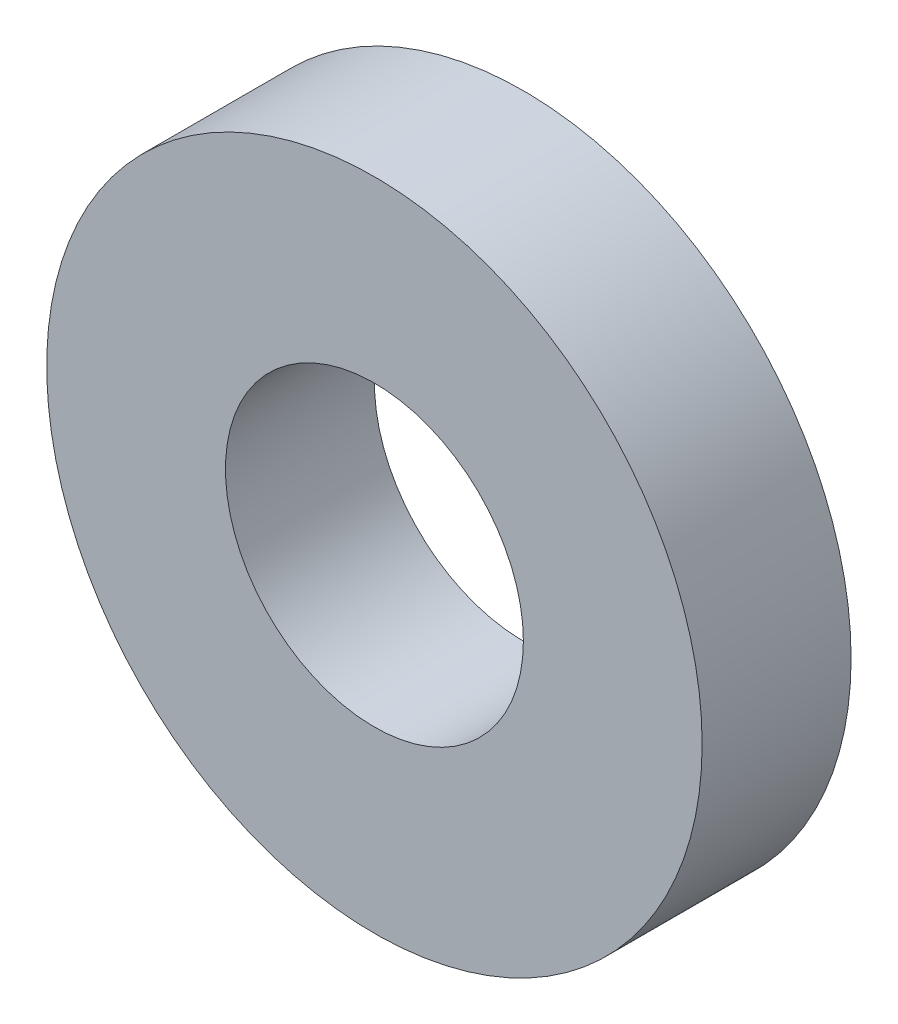
ISO-10303-21;
HEADER;
FILE_DESCRIPTION(('STEP AP214'),'2;1');
FILE_NAME('part.step','',(''),(''),'','','');
FILE_SCHEMA(('AUTOMOTIVE_DESIGN { 1 0 10303 214 1 1 1 1 }'));
ENDSEC;
DATA;
#1=APPLICATION_CONTEXT('core data for automotive mechanical design processes');
#2=APPLICATION_PROTOCOL_DEFINITION('international standard','automotive_design',2000,#1);
#3=PRODUCT_CONTEXT('',#1,'mechanical');
#4=PRODUCT('Part','Part','',(#3));
#5=PRODUCT_RELATED_PRODUCT_CATEGORY('part','',(#4));
#6=PRODUCT_DEFINITION_FORMATION('','',#4);
#7=PRODUCT_DEFINITION_CONTEXT('part definition',#1,'design');
#8=PRODUCT_DEFINITION('design','',#6,#7);
#9=PRODUCT_DEFINITION_SHAPE('','',#8);
#10=(LENGTH_UNIT() NAMED_UNIT(*) SI_UNIT(.MILLI.,.METRE.));
#11=(NAMED_UNIT(*) PLANE_ANGLE_UNIT() SI_UNIT($,.RADIAN.));
#12=(NAMED_UNIT(*) SI_UNIT($,.STERADIAN.) SOLID_ANGLE_UNIT());
#13=UNCERTAINTY_MEASURE_WITH_UNIT(LENGTH_MEASURE(1.E-05),#10,'distance_accuracy_value','');
#14=(GEOMETRIC_REPRESENTATION_CONTEXT(3) GLOBAL_UNCERTAINTY_ASSIGNED_CONTEXT((#13)) GLOBAL_UNIT_ASSIGNED_CONTEXT((#10,
#11,#12)) REPRESENTATION_CONTEXT('',''));
#15=CARTESIAN_POINT('',(0.,0.,0.));
#16=DIRECTION('',(0.,0.,1.));
#17=DIRECTION('',(1.,0.,0.));
#18=AXIS2_PLACEMENT_3D('',#15,#16,#17);
#19=CARTESIAN_POINT('',(0.,0.,6.));
#20=DIRECTION('',(0.,0.,1.));
#21=DIRECTION('',(1.,0.,0.));
#22=AXIS2_PLACEMENT_3D('',#19,#20,#21);
#23=PLANE('',#22);
#24=CARTESIAN_POINT('',(0.,0.,6.));
#25=DIRECTION('',(0.,0.,1.));
#26=DIRECTION('',(1.,0.,0.));
#27=AXIS2_PLACEMENT_3D('',#24,#25,#26);
#28=CIRCLE('',#27,13.2);
#29=CARTESIAN_POINT('',(13.2,0.,6.));
#30=VERTEX_POINT('',#29);
#31=EDGE_CURVE('E10',#30,#30,#28,.T.);
#32=ORIENTED_EDGE('',*,*,#31,.T.);
#33=EDGE_LOOP('',(#32));
#34=FACE_BOUND('',#33,.T.);
#35=CARTESIAN_POINT('',(0.,0.,6.));
#36=DIRECTION('',(0.,0.,1.));
#37=DIRECTION('',(1.,0.,0.));
#38=AXIS2_PLACEMENT_3D('',#35,#36,#37);
#39=CIRCLE('',#38,6.);
#40=CARTESIAN_POINT('',(6.,0.,6.));
#41=VERTEX_POINT('',#40);
#42=EDGE_CURVE('E46',#41,#41,#39,.T.);
#43=ORIENTED_EDGE('',*,*,#42,.F.);
#44=EDGE_LOOP('',(#43));
#45=FACE_BOUND('',#44,.T.);
#46=ADVANCED_FACE('F35',(#34,#45),#23,.T.);
#47=CARTESIAN_POINT('',(0.,0.,0.));
#48=DIRECTION('',(0.,0.,1.));
#49=DIRECTION('',(1.,0.,0.));
#50=AXIS2_PLACEMENT_3D('',#47,#48,#49);
#51=PLANE('',#50);
#52=CARTESIAN_POINT('',(0.,0.,0.));
#53=DIRECTION('',(0.,0.,1.));
#54=DIRECTION('',(1.,0.,0.));
#55=AXIS2_PLACEMENT_3D('',#52,#53,#54);
#56=CIRCLE('',#55,13.2);
#57=CARTESIAN_POINT('',(13.2,0.,0.));
#58=VERTEX_POINT('',#57);
#59=EDGE_CURVE('E39',#58,#58,#56,.T.);
#60=ORIENTED_EDGE('',*,*,#59,.F.);
#61=EDGE_LOOP('',(#60));
#62=FACE_BOUND('',#61,.T.);
#63=CARTESIAN_POINT('',(0.,0.,0.));
#64=DIRECTION('',(0.,0.,1.));
#65=DIRECTION('',(1.,0.,0.));
#66=AXIS2_PLACEMENT_3D('',#63,#64,#65);
#67=CIRCLE('',#66,6.);
#68=CARTESIAN_POINT('',(6.,0.,0.));
#69=VERTEX_POINT('',#68);
#70=EDGE_CURVE('E48',#69,#69,#67,.T.);
#71=ORIENTED_EDGE('',*,*,#70,.T.);
#72=EDGE_LOOP('',(#71));
#73=FACE_BOUND('',#72,.T.);
#74=ADVANCED_FACE('F58',(#62,#73),#51,.F.);
#75=CARTESIAN_POINT('',(0.,0.,6.));
#76=DIRECTION('',(0.,0.,-1.));
#77=DIRECTION('',(-1.,0.,0.));
#78=AXIS2_PLACEMENT_3D('',#75,#76,#77);
#79=CYLINDRICAL_SURFACE('',#78,13.2);
#80=ORIENTED_EDGE('',*,*,#31,.F.);
#81=EDGE_LOOP('',(#80));
#82=FACE_BOUND('',#81,.T.);
#83=ORIENTED_EDGE('',*,*,#59,.T.);
#84=EDGE_LOOP('',(#83));
#85=FACE_BOUND('',#84,.T.);
#86=ADVANCED_FACE('F37',(#82,#85),#79,.T.);
#87=CARTESIAN_POINT('',(0.,0.,6.));
#88=DIRECTION('',(0.,0.,-1.));
#89=DIRECTION('',(-1.,0.,0.));
#90=AXIS2_PLACEMENT_3D('',#87,#88,#89);
#91=CYLINDRICAL_SURFACE('',#90,6.);
#92=ORIENTED_EDGE('',*,*,#42,.T.);
#93=EDGE_LOOP('',(#92));
#94=FACE_BOUND('',#93,.T.);
#95=ORIENTED_EDGE('',*,*,#70,.F.);
#96=EDGE_LOOP('',(#95));
#97=FACE_BOUND('',#96,.T.);
#98=ADVANCED_FACE('F54',(#94,#97),#91,.F.);
#99=CLOSED_SHELL('',(#46,#74,#86,#98));
#100=MANIFOLD_SOLID_BREP('B2',#99);
#101=ADVANCED_BREP_SHAPE_REPRESENTATION('',(#18,#100),#14);
#102=SHAPE_DEFINITION_REPRESENTATION(#9,#101);
ENDSEC;
END-ISO-10303-21;
